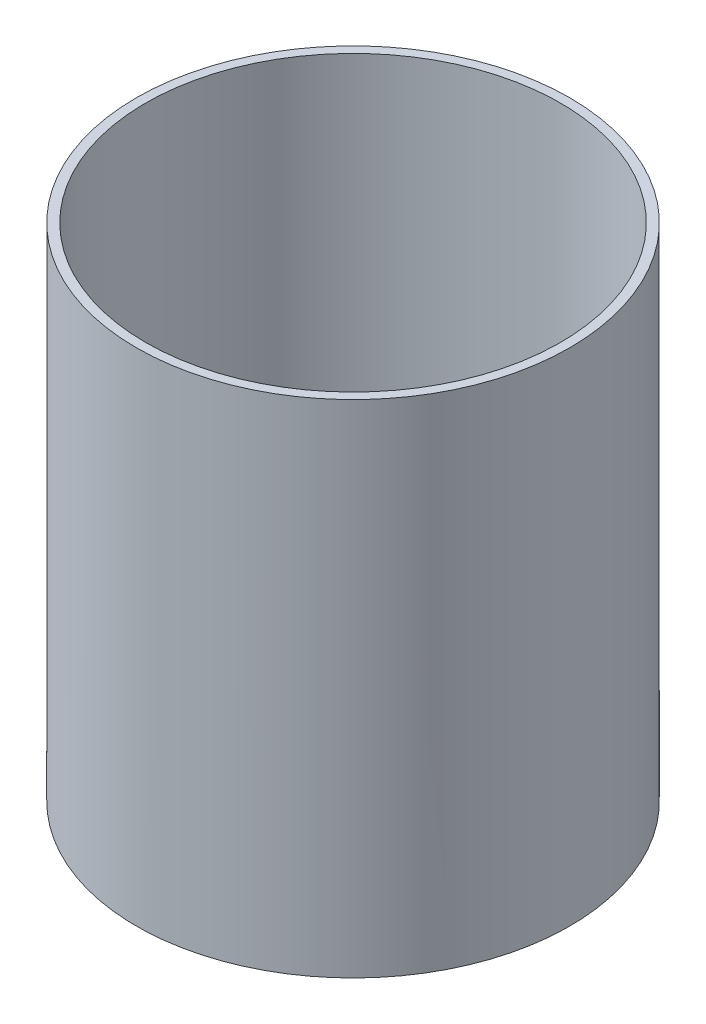
ISO-10303-21;
HEADER;
FILE_DESCRIPTION(('STEP AP214'),'2;1');
FILE_NAME('part.step','',(''),(''),'','','');
FILE_SCHEMA(('AUTOMOTIVE_DESIGN { 1 0 10303 214 1 1 1 1 }'));
ENDSEC;
DATA;
#1=APPLICATION_CONTEXT('core data for automotive mechanical design processes');
#2=APPLICATION_PROTOCOL_DEFINITION('international standard','automotive_design',2000,#1);
#3=PRODUCT_CONTEXT('',#1,'mechanical');
#4=PRODUCT('Part','Part','',(#3));
#5=PRODUCT_RELATED_PRODUCT_CATEGORY('part','',(#4));
#6=PRODUCT_DEFINITION_FORMATION('','',#4);
#7=PRODUCT_DEFINITION_CONTEXT('part definition',#1,'design');
#8=PRODUCT_DEFINITION('design','',#6,#7);
#9=PRODUCT_DEFINITION_SHAPE('','',#8);
#10=(LENGTH_UNIT() NAMED_UNIT(*) SI_UNIT(.MILLI.,.METRE.));
#11=(NAMED_UNIT(*) PLANE_ANGLE_UNIT() SI_UNIT($,.RADIAN.));
#12=(NAMED_UNIT(*) SI_UNIT($,.STERADIAN.) SOLID_ANGLE_UNIT());
#13=UNCERTAINTY_MEASURE_WITH_UNIT(LENGTH_MEASURE(1.E-05),#10,'distance_accuracy_value','');
#14=(GEOMETRIC_REPRESENTATION_CONTEXT(3) GLOBAL_UNCERTAINTY_ASSIGNED_CONTEXT((#13)) GLOBAL_UNIT_ASSIGNED_CONTEXT((#10,
#11,#12)) REPRESENTATION_CONTEXT('',''));
#15=CARTESIAN_POINT('',(0.,0.,0.));
#16=DIRECTION('',(0.,0.,1.));
#17=DIRECTION('',(1.,0.,0.));
#18=AXIS2_PLACEMENT_3D('',#15,#16,#17);
#19=CARTESIAN_POINT('',(0.,114.3,0.));
#20=DIRECTION('',(0.,1.,0.));
#21=DIRECTION('',(0.,0.,1.));
#22=AXIS2_PLACEMENT_3D('',#19,#20,#21);
#23=PLANE('',#22);
#24=CARTESIAN_POINT('',(0.,114.3,0.));
#25=DIRECTION('',(0.,1.,0.));
#26=DIRECTION('',(0.,0.,1.));
#27=AXIS2_PLACEMENT_3D('',#24,#25,#26);
#28=CIRCLE('',#27,50.8);
#29=CARTESIAN_POINT('',(0.,114.3,50.8));
#30=VERTEX_POINT('',#29);
#31=EDGE_CURVE('E10',#30,#30,#28,.T.);
#32=ORIENTED_EDGE('',*,*,#31,.T.);
#33=EDGE_LOOP('',(#32));
#34=FACE_BOUND('',#33,.T.);
#35=CARTESIAN_POINT('',(0.,114.3,0.));
#36=DIRECTION('',(0.,1.,0.));
#37=DIRECTION('',(0.,0.,1.));
#38=AXIS2_PLACEMENT_3D('',#35,#36,#37);
#39=CIRCLE('',#38,48.641);
#40=CARTESIAN_POINT('',(0.,114.3,48.641));
#41=VERTEX_POINT('',#40);
#42=EDGE_CURVE('E46',#41,#41,#39,.T.);
#43=ORIENTED_EDGE('',*,*,#42,.F.);
#44=EDGE_LOOP('',(#43));
#45=FACE_BOUND('',#44,.T.);
#46=ADVANCED_FACE('F39',(#34,#45),#23,.T.);
#47=CARTESIAN_POINT('',(0.,114.3,0.));
#48=DIRECTION('',(0.,-1.,0.));
#49=DIRECTION('',(0.,0.,-1.));
#50=AXIS2_PLACEMENT_3D('',#47,#48,#49);
#51=CYLINDRICAL_SURFACE('',#50,50.8);
#52=ORIENTED_EDGE('',*,*,#31,.F.);
#53=EDGE_LOOP('',(#52));
#54=FACE_BOUND('',#53,.T.);
#55=CARTESIAN_POINT('',(0.,-3.175,0.));
#56=DIRECTION('',(0.,-1.,0.));
#57=DIRECTION('',(0.,0.,-1.));
#58=AXIS2_PLACEMENT_3D('',#55,#56,#57);
#59=CIRCLE('',#58,50.8);
#60=CARTESIAN_POINT('',(0.,-3.175,-50.8));
#61=VERTEX_POINT('',#60);
#62=EDGE_CURVE('E55',#61,#61,#59,.T.);
#63=ORIENTED_EDGE('',*,*,#62,.F.);
#64=EDGE_LOOP('',(#63));
#65=FACE_BOUND('',#64,.T.);
#66=ADVANCED_FACE('F41',(#54,#65),#51,.T.);
#67=CARTESIAN_POINT('',(0.,114.3,0.));
#68=DIRECTION('',(0.,-1.,0.));
#69=DIRECTION('',(0.,0.,-1.));
#70=AXIS2_PLACEMENT_3D('',#67,#68,#69);
#71=CYLINDRICAL_SURFACE('',#70,48.641);
#72=ORIENTED_EDGE('',*,*,#42,.T.);
#73=EDGE_LOOP('',(#72));
#74=FACE_BOUND('',#73,.T.);
#75=CARTESIAN_POINT('',(0.,0.,0.));
#76=DIRECTION('',(0.,1.,0.));
#77=DIRECTION('',(0.,0.,1.));
#78=AXIS2_PLACEMENT_3D('',#75,#76,#77);
#79=CIRCLE('',#78,48.641);
#80=CARTESIAN_POINT('',(0.,0.,48.641));
#81=VERTEX_POINT('',#80);
#82=EDGE_CURVE('E50',#81,#81,#79,.T.);
#83=ORIENTED_EDGE('',*,*,#82,.F.);
#84=EDGE_LOOP('',(#83));
#85=FACE_BOUND('',#84,.T.);
#86=ADVANCED_FACE('F84',(#74,#85),#71,.F.);
#87=CARTESIAN_POINT('',(0.,0.,0.));
#88=DIRECTION('',(0.,-1.,0.));
#89=DIRECTION('',(0.,0.,-1.));
#90=AXIS2_PLACEMENT_3D('',#87,#88,#89);
#91=PLANE('',#90);
#92=CARTESIAN_POINT('',(-38.1,0.,0.));
#93=DIRECTION('',(0.,-1.,0.));
#94=DIRECTION('',(0.,0.,-1.));
#95=AXIS2_PLACEMENT_3D('',#92,#93,#94);
#96=CIRCLE('',#95,3.175);
#97=CARTESIAN_POINT('',(-38.1,0.,-3.175));
#98=VERTEX_POINT('',#97);
#99=EDGE_CURVE('E57',#98,#98,#96,.T.);
#100=ORIENTED_EDGE('',*,*,#99,.T.);
#101=EDGE_LOOP('',(#100));
#102=FACE_BOUND('',#101,.T.);
#103=CARTESIAN_POINT('',(38.1,0.,0.));
#104=DIRECTION('',(0.,-1.,0.));
#105=DIRECTION('',(0.,0.,-1.));
#106=AXIS2_PLACEMENT_3D('',#103,#104,#105);
#107=CIRCLE('',#106,3.17500000000001);
#108=CARTESIAN_POINT('',(38.1,0.,-3.17500000000001));
#109=VERTEX_POINT('',#108);
#110=EDGE_CURVE('E61',#109,#109,#107,.T.);
#111=ORIENTED_EDGE('',*,*,#110,.T.);
#112=EDGE_LOOP('',(#111));
#113=FACE_BOUND('',#112,.T.);
#114=ORIENTED_EDGE('',*,*,#82,.T.);
#115=EDGE_LOOP('',(#114));
#116=FACE_BOUND('',#115,.T.);
#117=ADVANCED_FACE('F90',(#102,#113,#116),#91,.F.);
#118=CARTESIAN_POINT('',(-38.1,-3.175,0.));
#119=DIRECTION('',(0.,1.,0.));
#120=DIRECTION('',(0.,0.,1.));
#121=AXIS2_PLACEMENT_3D('',#118,#119,#120);
#122=CYLINDRICAL_SURFACE('',#121,3.175);
#123=CARTESIAN_POINT('',(-38.1,-3.175,0.));
#124=DIRECTION('',(0.,-1.,0.));
#125=DIRECTION('',(0.,0.,-1.));
#126=AXIS2_PLACEMENT_3D('',#123,#124,#125);
#127=CIRCLE('',#126,3.175);
#128=CARTESIAN_POINT('',(-38.1,-3.175,-3.175));
#129=VERTEX_POINT('',#128);
#130=EDGE_CURVE('E66',#129,#129,#127,.T.);
#131=ORIENTED_EDGE('',*,*,#130,.T.);
#132=EDGE_LOOP('',(#131));
#133=FACE_BOUND('',#132,.T.);
#134=ORIENTED_EDGE('',*,*,#99,.F.);
#135=EDGE_LOOP('',(#134));
#136=FACE_BOUND('',#135,.T.);
#137=ADVANCED_FACE('F99',(#133,#136),#122,.F.);
#138=CARTESIAN_POINT('',(38.1,-3.175,0.));
#139=DIRECTION('',(0.,1.,0.));
#140=DIRECTION('',(0.,0.,1.));
#141=AXIS2_PLACEMENT_3D('',#138,#139,#140);
#142=CYLINDRICAL_SURFACE('',#141,3.17500000000001);
#143=CARTESIAN_POINT('',(38.1,-3.175,0.));
#144=DIRECTION('',(0.,-1.,0.));
#145=DIRECTION('',(0.,0.,-1.));
#146=AXIS2_PLACEMENT_3D('',#143,#144,#145);
#147=CIRCLE('',#146,3.17500000000001);
#148=CARTESIAN_POINT('',(38.1,-3.175,-3.17500000000001));
#149=VERTEX_POINT('',#148);
#150=EDGE_CURVE('E60',#149,#149,#147,.T.);
#151=ORIENTED_EDGE('',*,*,#150,.T.);
#152=EDGE_LOOP('',(#151));
#153=FACE_BOUND('',#152,.T.);
#154=ORIENTED_EDGE('',*,*,#110,.F.);
#155=EDGE_LOOP('',(#154));
#156=FACE_BOUND('',#155,.T.);
#157=ADVANCED_FACE('F72',(#153,#156),#142,.F.);
#158=CARTESIAN_POINT('',(0.,-3.175,0.));
#159=DIRECTION('',(0.,-1.,0.));
#160=DIRECTION('',(0.,0.,-1.));
#161=AXIS2_PLACEMENT_3D('',#158,#159,#160);
#162=PLANE('',#161);
#163=ORIENTED_EDGE('',*,*,#150,.F.);
#164=EDGE_LOOP('',(#163));
#165=FACE_BOUND('',#164,.T.);
#166=ORIENTED_EDGE('',*,*,#130,.F.);
#167=EDGE_LOOP('',(#166));
#168=FACE_BOUND('',#167,.T.);
#169=ORIENTED_EDGE('',*,*,#62,.T.);
#170=EDGE_LOOP('',(#169));
#171=FACE_BOUND('',#170,.T.);
#172=ADVANCED_FACE('F75',(#165,#168,#171),#162,.T.);
#173=CLOSED_SHELL('',(#46,#66,#86,#117,#137,#157,#172));
#174=MANIFOLD_SOLID_BREP('B2',#173);
#175=ADVANCED_BREP_SHAPE_REPRESENTATION('',(#18,#174),#14);
#176=SHAPE_DEFINITION_REPRESENTATION(#9,#175);
ENDSEC;
END-ISO-10303-21;
